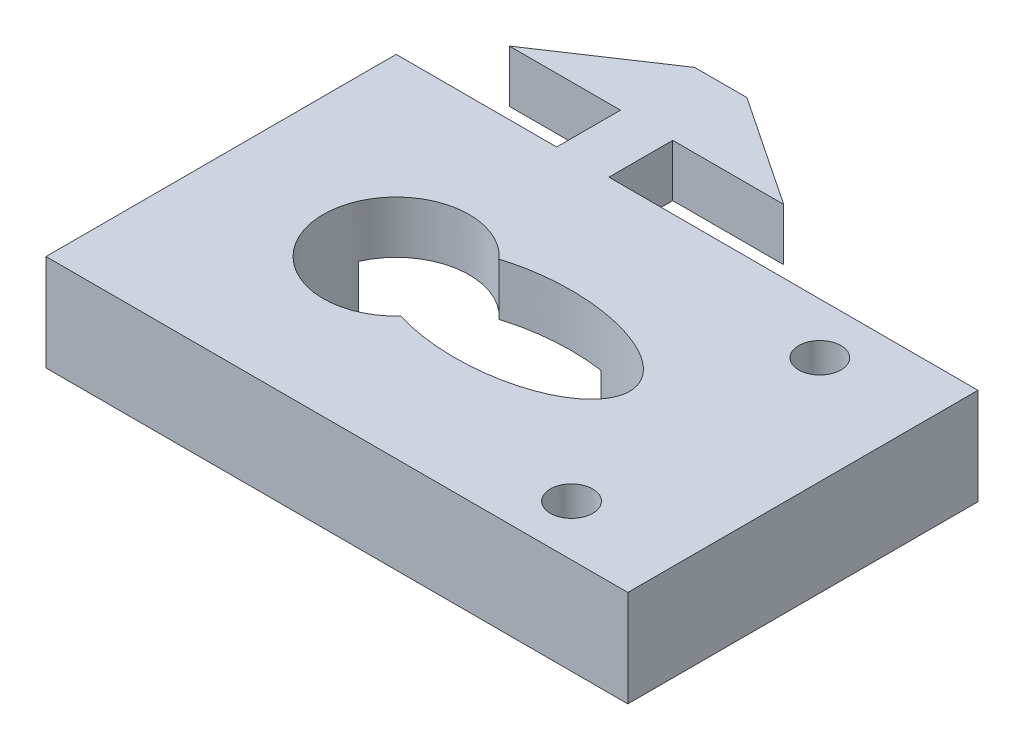
ISO-10303-21;
HEADER;
FILE_DESCRIPTION(('STEP AP214'),'2;1');
FILE_NAME('part.step','',(''),(''),'','','');
FILE_SCHEMA(('AUTOMOTIVE_DESIGN { 1 0 10303 214 1 1 1 1 }'));
ENDSEC;
DATA;
#1=APPLICATION_CONTEXT('core data for automotive mechanical design processes');
#2=APPLICATION_PROTOCOL_DEFINITION('international standard','automotive_design',2000,#1);
#3=PRODUCT_CONTEXT('',#1,'mechanical');
#4=PRODUCT('Part','Part','',(#3));
#5=PRODUCT_RELATED_PRODUCT_CATEGORY('part','',(#4));
#6=PRODUCT_DEFINITION_FORMATION('','',#4);
#7=PRODUCT_DEFINITION_CONTEXT('part definition',#1,'design');
#8=PRODUCT_DEFINITION('design','',#6,#7);
#9=PRODUCT_DEFINITION_SHAPE('','',#8);
#10=(LENGTH_UNIT() NAMED_UNIT(*) SI_UNIT(.MILLI.,.METRE.));
#11=(NAMED_UNIT(*) PLANE_ANGLE_UNIT() SI_UNIT($,.RADIAN.));
#12=(NAMED_UNIT(*) SI_UNIT($,.STERADIAN.) SOLID_ANGLE_UNIT());
#13=UNCERTAINTY_MEASURE_WITH_UNIT(LENGTH_MEASURE(1.E-05),#10,'distance_accuracy_value','');
#14=(GEOMETRIC_REPRESENTATION_CONTEXT(3) GLOBAL_UNCERTAINTY_ASSIGNED_CONTEXT((#13)) GLOBAL_UNIT_ASSIGNED_CONTEXT((#10,
#11,#12)) REPRESENTATION_CONTEXT('',''));
#15=CARTESIAN_POINT('',(0.,0.,0.));
#16=DIRECTION('',(0.,0.,1.));
#17=DIRECTION('',(1.,0.,0.));
#18=AXIS2_PLACEMENT_3D('',#15,#16,#17);
#19=CARTESIAN_POINT('',(0.,3.5814,2.1874988));
#20=DIRECTION('',(0.,0.,1.));
#21=DIRECTION('',(1.,0.,0.));
#22=AXIS2_PLACEMENT_3D('',#19,#20,#21);
#23=PLANE('',#22);
#24=DIRECTION('',(-1.,0.,0.));
#25=VECTOR('',#24,1.);
#26=CARTESIAN_POINT('',(-12.79,-3.035,2.18749880000001));
#27=LINE('',#26,#25);
#28=CARTESIAN_POINT('',(27.088,-3.035,2.18749880000001));
#29=VERTEX_POINT('',#28);
#30=CARTESIAN_POINT('',(9.398,-3.035,2.18749879999999));
#31=VERTEX_POINT('',#30);
#32=EDGE_CURVE('E283',#29,#31,#27,.T.);
#33=ORIENTED_EDGE('',*,*,#32,.T.);
#34=DIRECTION('',(0.,-1.,0.));
#35=VECTOR('',#34,1.);
#36=CARTESIAN_POINT('',(9.398,0.,2.18749879999999));
#37=LINE('',#36,#35);
#38=CARTESIAN_POINT('',(9.398,0.,2.18749879999999));
#39=VERTEX_POINT('',#38);
#40=EDGE_CURVE('E284',#39,#31,#37,.T.);
#41=ORIENTED_EDGE('',*,*,#40,.F.);
#42=DIRECTION('',(1.,0.,0.));
#43=VECTOR('',#42,1.);
#44=CARTESIAN_POINT('',(9.398,0.,2.18749879999999));
#45=LINE('',#44,#43);
#46=CARTESIAN_POINT('',(1.7907,0.,2.1874988));
#47=VERTEX_POINT('',#46);
#48=EDGE_CURVE('E407',#47,#39,#45,.T.);
#49=ORIENTED_EDGE('',*,*,#48,.F.);
#50=DIRECTION('',(0.,-1.,0.));
#51=VECTOR('',#50,1.);
#52=CARTESIAN_POINT('',(1.7907,3.5814,2.1874988));
#53=LINE('',#52,#51);
#54=CARTESIAN_POINT('',(1.7907,3.5814,2.1874988));
#55=VERTEX_POINT('',#54);
#56=EDGE_CURVE('E367',#55,#47,#53,.T.);
#57=ORIENTED_EDGE('',*,*,#56,.F.);
#58=DIRECTION('',(1.,0.,0.));
#59=VECTOR('',#58,1.);
#60=CARTESIAN_POINT('',(0.,3.5814,2.1874988));
#61=LINE('',#60,#59);
#62=CARTESIAN_POINT('',(27.088,3.5814,2.1874988));
#63=VERTEX_POINT('',#62);
#64=EDGE_CURVE('E305',#55,#63,#61,.T.);
#65=ORIENTED_EDGE('',*,*,#64,.T.);
#66=DIRECTION('',(0.,-1.,0.));
#67=VECTOR('',#66,1.);
#68=CARTESIAN_POINT('',(27.088,3.5814,2.1874988));
#69=LINE('',#68,#67);
#70=EDGE_CURVE('E287',#63,#29,#69,.T.);
#71=ORIENTED_EDGE('',*,*,#70,.T.);
#72=EDGE_LOOP('',(#33,#41,#49,#57,#65,#71));
#73=FACE_BOUND('',#72,.T.);
#74=ADVANCED_FACE('F35',(#73),#23,.F.);
#75=CARTESIAN_POINT('',(0.,3.5814,26.1874988));
#76=DIRECTION('',(0.,0.,-1.));
#77=DIRECTION('',(-1.,0.,0.));
#78=AXIS2_PLACEMENT_3D('',#75,#76,#77);
#79=PLANE('',#78);
#80=DIRECTION('',(0.,-1.,0.));
#81=VECTOR('',#80,1.);
#82=CARTESIAN_POINT('',(-12.79,3.5814,26.1874988));
#83=LINE('',#82,#81);
#84=CARTESIAN_POINT('',(-12.79,3.5814,26.1874988));
#85=VERTEX_POINT('',#84);
#86=CARTESIAN_POINT('',(-12.79,-3.035,26.1874988));
#87=VERTEX_POINT('',#86);
#88=EDGE_CURVE('E330',#85,#87,#83,.T.);
#89=ORIENTED_EDGE('',*,*,#88,.T.);
#90=DIRECTION('',(1.,0.,0.));
#91=VECTOR('',#90,1.);
#92=CARTESIAN_POINT('',(-12.79,-3.035,26.1874988));
#93=LINE('',#92,#91);
#94=CARTESIAN_POINT('',(27.088,-3.035,26.1874988));
#95=VERTEX_POINT('',#94);
#96=EDGE_CURVE('E395',#87,#95,#93,.T.);
#97=ORIENTED_EDGE('',*,*,#96,.T.);
#98=DIRECTION('',(0.,-1.,0.));
#99=VECTOR('',#98,1.);
#100=CARTESIAN_POINT('',(27.088,3.5814,26.1874988));
#101=LINE('',#100,#99);
#102=CARTESIAN_POINT('',(27.088,3.5814,26.1874988));
#103=VERTEX_POINT('',#102);
#104=EDGE_CURVE('E371',#103,#95,#101,.T.);
#105=ORIENTED_EDGE('',*,*,#104,.F.);
#106=DIRECTION('',(1.,0.,0.));
#107=VECTOR('',#106,1.);
#108=CARTESIAN_POINT('',(0.,3.5814,26.1874988));
#109=LINE('',#108,#107);
#110=EDGE_CURVE('E299',#85,#103,#109,.T.);
#111=ORIENTED_EDGE('',*,*,#110,.F.);
#112=EDGE_LOOP('',(#89,#97,#105,#111));
#113=FACE_BOUND('',#112,.T.);
#114=ADVANCED_FACE('F37',(#113),#79,.F.);
#115=CARTESIAN_POINT('',(27.088,3.5814,0.));
#116=DIRECTION('',(-1.,0.,0.));
#117=DIRECTION('',(0.,0.,1.));
#118=AXIS2_PLACEMENT_3D('',#115,#116,#117);
#119=PLANE('',#118);
#120=ORIENTED_EDGE('',*,*,#104,.T.);
#121=DIRECTION('',(0.,0.,-1.));
#122=VECTOR('',#121,1.);
#123=CARTESIAN_POINT('',(27.088,-3.035,2.18749880000001));
#124=LINE('',#123,#122);
#125=EDGE_CURVE('E295',#95,#29,#124,.T.);
#126=ORIENTED_EDGE('',*,*,#125,.T.);
#127=ORIENTED_EDGE('',*,*,#70,.F.);
#128=DIRECTION('',(0.,0.,-1.));
#129=VECTOR('',#128,1.);
#130=CARTESIAN_POINT('',(27.088,3.5814,0.));
#131=LINE('',#130,#129);
#132=EDGE_CURVE('E302',#103,#63,#131,.T.);
#133=ORIENTED_EDGE('',*,*,#132,.F.);
#134=EDGE_LOOP('',(#120,#126,#127,#133));
#135=FACE_BOUND('',#134,.T.);
#136=ADVANCED_FACE('F268',(#135),#119,.F.);
#137=CARTESIAN_POINT('',(1.7907,3.5814,0.));
#138=DIRECTION('',(-1.,0.,0.));
#139=DIRECTION('',(0.,0.,1.));
#140=AXIS2_PLACEMENT_3D('',#137,#138,#139);
#141=PLANE('',#140);
#142=DIRECTION('',(0.,0.,-1.));
#143=VECTOR('',#142,1.);
#144=CARTESIAN_POINT('',(1.7907,0.,0.));
#145=LINE('',#144,#143);
#146=CARTESIAN_POINT('',(1.7907,0.,-2.1874988));
#147=VERTEX_POINT('',#146);
#148=EDGE_CURVE('E290',#47,#147,#145,.T.);
#149=ORIENTED_EDGE('',*,*,#148,.T.);
#150=DIRECTION('',(0.,-1.,0.));
#151=VECTOR('',#150,1.);
#152=CARTESIAN_POINT('',(1.7907,3.5814,-2.1874988));
#153=LINE('',#152,#151);
#154=CARTESIAN_POINT('',(1.7907,3.5814,-2.1874988));
#155=VERTEX_POINT('',#154);
#156=EDGE_CURVE('E365',#155,#147,#153,.T.);
#157=ORIENTED_EDGE('',*,*,#156,.F.);
#158=DIRECTION('',(0.,0.,-1.));
#159=VECTOR('',#158,1.);
#160=CARTESIAN_POINT('',(1.7907,3.5814,0.));
#161=LINE('',#160,#159);
#162=EDGE_CURVE('E307',#55,#155,#161,.T.);
#163=ORIENTED_EDGE('',*,*,#162,.F.);
#164=ORIENTED_EDGE('',*,*,#56,.T.);
#165=EDGE_LOOP('',(#149,#157,#163,#164));
#166=FACE_BOUND('',#165,.T.);
#167=ADVANCED_FACE('F265',(#166),#141,.F.);
#168=CARTESIAN_POINT('',(0.,3.5814,-2.1874988));
#169=DIRECTION('',(0.,0.,1.));
#170=DIRECTION('',(1.,0.,0.));
#171=AXIS2_PLACEMENT_3D('',#168,#169,#170);
#172=PLANE('',#171);
#173=DIRECTION('',(-1.,0.,0.));
#174=VECTOR('',#173,1.);
#175=CARTESIAN_POINT('',(0.,0.,-2.1874988));
#176=LINE('',#175,#174);
#177=CARTESIAN_POINT('',(9.398,0.,-2.1874988));
#178=VERTEX_POINT('',#177);
#179=EDGE_CURVE('E293',#178,#147,#176,.T.);
#180=ORIENTED_EDGE('',*,*,#179,.F.);
#181=DIRECTION('',(0.,-1.,0.));
#182=VECTOR('',#181,1.);
#183=CARTESIAN_POINT('',(9.398,3.5814,-2.1874988));
#184=LINE('',#183,#182);
#185=CARTESIAN_POINT('',(9.398,3.5814,-2.1874988));
#186=VERTEX_POINT('',#185);
#187=EDGE_CURVE('E363',#186,#178,#184,.T.);
#188=ORIENTED_EDGE('',*,*,#187,.F.);
#189=DIRECTION('',(-1.,0.,0.));
#190=VECTOR('',#189,1.);
#191=CARTESIAN_POINT('',(0.,3.5814,-2.1874988));
#192=LINE('',#191,#190);
#193=EDGE_CURVE('E309',#186,#155,#192,.T.);
#194=ORIENTED_EDGE('',*,*,#193,.T.);
#195=ORIENTED_EDGE('',*,*,#156,.T.);
#196=EDGE_LOOP('',(#180,#188,#194,#195));
#197=FACE_BOUND('',#196,.T.);
#198=ADVANCED_FACE('F261',(#197),#172,.T.);
#199=CARTESIAN_POINT('',(3.90863686168685,3.5814,-5.85318370037606));
#200=DIRECTION('',(0.55534080959066,0.,-0.831622862362014));
#201=DIRECTION('',(-0.831622862362014,0.,-0.55534080959066));
#202=AXIS2_PLACEMENT_3D('',#199,#200,#201);
#203=PLANE('',#202);
#204=DIRECTION('',(0.831622862362014,0.,0.55534080959066));
#205=VECTOR('',#204,1.);
#206=CARTESIAN_POINT('',(3.90863686168685,0.,-5.85318370037606));
#207=LINE('',#206,#205);
#208=CARTESIAN_POINT('',(1.7907,0.,-7.2674988));
#209=VERTEX_POINT('',#208);
#210=EDGE_CURVE('E334',#209,#178,#207,.T.);
#211=ORIENTED_EDGE('',*,*,#210,.F.);
#212=DIRECTION('',(0.,-1.,0.));
#213=VECTOR('',#212,1.);
#214=CARTESIAN_POINT('',(1.7907,3.5814,-7.2674988));
#215=LINE('',#214,#213);
#216=CARTESIAN_POINT('',(1.7907,3.5814,-7.2674988));
#217=VERTEX_POINT('',#216);
#218=EDGE_CURVE('E361',#217,#209,#215,.T.);
#219=ORIENTED_EDGE('',*,*,#218,.F.);
#220=DIRECTION('',(0.831622862362014,0.,0.55534080959066));
#221=VECTOR('',#220,1.);
#222=CARTESIAN_POINT('',(3.90863686168685,3.5814,-5.85318370037606));
#223=LINE('',#222,#221);
#224=EDGE_CURVE('E312',#217,#186,#223,.T.);
#225=ORIENTED_EDGE('',*,*,#224,.T.);
#226=ORIENTED_EDGE('',*,*,#187,.T.);
#227=EDGE_LOOP('',(#211,#219,#225,#226));
#228=FACE_BOUND('',#227,.T.);
#229=ADVANCED_FACE('F257',(#228),#203,.T.);
#230=CARTESIAN_POINT('',(0.,3.5814,-7.2674988));
#231=DIRECTION('',(0.,0.,-1.));
#232=DIRECTION('',(-1.,0.,0.));
#233=AXIS2_PLACEMENT_3D('',#230,#231,#232);
#234=PLANE('',#233);
#235=DIRECTION('',(1.,0.,0.));
#236=VECTOR('',#235,1.);
#237=CARTESIAN_POINT('',(0.,0.,-7.2674988));
#238=LINE('',#237,#236);
#239=CARTESIAN_POINT('',(-1.7907,0.,-7.2674988));
#240=VERTEX_POINT('',#239);
#241=EDGE_CURVE('E337',#240,#209,#238,.T.);
#242=ORIENTED_EDGE('',*,*,#241,.F.);
#243=DIRECTION('',(0.,-1.,0.));
#244=VECTOR('',#243,1.);
#245=CARTESIAN_POINT('',(-1.7907,3.5814,-7.2674988));
#246=LINE('',#245,#244);
#247=CARTESIAN_POINT('',(-1.7907,3.5814,-7.2674988));
#248=VERTEX_POINT('',#247);
#249=EDGE_CURVE('E359',#248,#240,#246,.T.);
#250=ORIENTED_EDGE('',*,*,#249,.F.);
#251=DIRECTION('',(1.,0.,0.));
#252=VECTOR('',#251,1.);
#253=CARTESIAN_POINT('',(0.,3.5814,-7.2674988));
#254=LINE('',#253,#252);
#255=EDGE_CURVE('E315',#248,#217,#254,.T.);
#256=ORIENTED_EDGE('',*,*,#255,.T.);
#257=ORIENTED_EDGE('',*,*,#218,.T.);
#258=EDGE_LOOP('',(#242,#250,#256,#257));
#259=FACE_BOUND('',#258,.T.);
#260=ADVANCED_FACE('F253',(#259),#234,.T.);
#261=CARTESIAN_POINT('',(-3.90863686168685,3.5814,-5.85318370037606));
#262=DIRECTION('',(-0.55534080959066,0.,-0.831622862362014));
#263=DIRECTION('',(-0.831622862362014,0.,0.55534080959066));
#264=AXIS2_PLACEMENT_3D('',#261,#262,#263);
#265=PLANE('',#264);
#266=DIRECTION('',(0.831622862362014,0.,-0.55534080959066));
#267=VECTOR('',#266,1.);
#268=CARTESIAN_POINT('',(-3.90863686168685,0.,-5.85318370037606));
#269=LINE('',#268,#267);
#270=CARTESIAN_POINT('',(-9.398,0.,-2.1874988));
#271=VERTEX_POINT('',#270);
#272=EDGE_CURVE('E340',#271,#240,#269,.T.);
#273=ORIENTED_EDGE('',*,*,#272,.F.);
#274=DIRECTION('',(0.,-1.,0.));
#275=VECTOR('',#274,1.);
#276=CARTESIAN_POINT('',(-9.398,3.5814,-2.1874988));
#277=LINE('',#276,#275);
#278=CARTESIAN_POINT('',(-9.398,3.5814,-2.1874988));
#279=VERTEX_POINT('',#278);
#280=EDGE_CURVE('E357',#279,#271,#277,.T.);
#281=ORIENTED_EDGE('',*,*,#280,.F.);
#282=DIRECTION('',(0.831622862362014,0.,-0.55534080959066));
#283=VECTOR('',#282,1.);
#284=CARTESIAN_POINT('',(-3.90863686168685,3.5814,-5.85318370037606));
#285=LINE('',#284,#283);
#286=EDGE_CURVE('E318',#279,#248,#285,.T.);
#287=ORIENTED_EDGE('',*,*,#286,.T.);
#288=ORIENTED_EDGE('',*,*,#249,.T.);
#289=EDGE_LOOP('',(#273,#281,#287,#288));
#290=FACE_BOUND('',#289,.T.);
#291=ADVANCED_FACE('F249',(#290),#265,.T.);
#292=CARTESIAN_POINT('',(0.,3.5814,-2.1874988));
#293=DIRECTION('',(0.,0.,1.));
#294=DIRECTION('',(1.,0.,0.));
#295=AXIS2_PLACEMENT_3D('',#292,#293,#294);
#296=PLANE('',#295);
#297=DIRECTION('',(-1.,0.,0.));
#298=VECTOR('',#297,1.);
#299=CARTESIAN_POINT('',(0.,0.,-2.1874988));
#300=LINE('',#299,#298);
#301=CARTESIAN_POINT('',(-1.7907,0.,-2.1874988));
#302=VERTEX_POINT('',#301);
#303=EDGE_CURVE('E343',#302,#271,#300,.T.);
#304=ORIENTED_EDGE('',*,*,#303,.F.);
#305=DIRECTION('',(0.,-1.,0.));
#306=VECTOR('',#305,1.);
#307=CARTESIAN_POINT('',(-1.7907,3.5814,-2.1874988));
#308=LINE('',#307,#306);
#309=CARTESIAN_POINT('',(-1.7907,3.5814,-2.1874988));
#310=VERTEX_POINT('',#309);
#311=EDGE_CURVE('E355',#310,#302,#308,.T.);
#312=ORIENTED_EDGE('',*,*,#311,.F.);
#313=DIRECTION('',(-1.,0.,0.));
#314=VECTOR('',#313,1.);
#315=CARTESIAN_POINT('',(0.,3.5814,-2.1874988));
#316=LINE('',#315,#314);
#317=EDGE_CURVE('E321',#310,#279,#316,.T.);
#318=ORIENTED_EDGE('',*,*,#317,.T.);
#319=ORIENTED_EDGE('',*,*,#280,.T.);
#320=EDGE_LOOP('',(#304,#312,#318,#319));
#321=FACE_BOUND('',#320,.T.);
#322=ADVANCED_FACE('F245',(#321),#296,.T.);
#323=CARTESIAN_POINT('',(-1.7907,3.5814,0.));
#324=DIRECTION('',(-1.,0.,0.));
#325=DIRECTION('',(0.,0.,1.));
#326=AXIS2_PLACEMENT_3D('',#323,#324,#325);
#327=PLANE('',#326);
#328=DIRECTION('',(0.,0.,-1.));
#329=VECTOR('',#328,1.);
#330=CARTESIAN_POINT('',(-1.7907,0.,0.));
#331=LINE('',#330,#329);
#332=CARTESIAN_POINT('',(-1.7907,0.,2.1874988));
#333=VERTEX_POINT('',#332);
#334=EDGE_CURVE('E303',#333,#302,#331,.T.);
#335=ORIENTED_EDGE('',*,*,#334,.F.);
#336=DIRECTION('',(0.,-1.,0.));
#337=VECTOR('',#336,1.);
#338=CARTESIAN_POINT('',(-1.7907,3.5814,2.1874988));
#339=LINE('',#338,#337);
#340=CARTESIAN_POINT('',(-1.7907,3.5814,2.1874988));
#341=VERTEX_POINT('',#340);
#342=EDGE_CURVE('E352',#341,#333,#339,.T.);
#343=ORIENTED_EDGE('',*,*,#342,.F.);
#344=DIRECTION('',(0.,0.,-1.));
#345=VECTOR('',#344,1.);
#346=CARTESIAN_POINT('',(-1.7907,3.5814,0.));
#347=LINE('',#346,#345);
#348=EDGE_CURVE('E324',#341,#310,#347,.T.);
#349=ORIENTED_EDGE('',*,*,#348,.T.);
#350=ORIENTED_EDGE('',*,*,#311,.T.);
#351=EDGE_LOOP('',(#335,#343,#349,#350));
#352=FACE_BOUND('',#351,.T.);
#353=ADVANCED_FACE('F241',(#352),#327,.T.);
#354=ORIENTED_EDGE('',*,*,#342,.T.);
#355=CARTESIAN_POINT('',(-9.398,0.,2.1874988));
#356=VERTEX_POINT('',#355);
#357=EDGE_CURVE('E175',#356,#333,#45,.T.);
#358=ORIENTED_EDGE('',*,*,#357,.F.);
#359=DIRECTION('',(0.,1.,0.));
#360=VECTOR('',#359,1.);
#361=CARTESIAN_POINT('',(-9.398,0.,2.1874988));
#362=LINE('',#361,#360);
#363=CARTESIAN_POINT('',(-9.39799999999999,-3.035,2.1874988));
#364=VERTEX_POINT('',#363);
#365=EDGE_CURVE('E406',#364,#356,#362,.T.);
#366=ORIENTED_EDGE('',*,*,#365,.F.);
#367=CARTESIAN_POINT('',(-12.79,-3.035,2.18749880000001));
#368=VERTEX_POINT('',#367);
#369=EDGE_CURVE('E188',#364,#368,#27,.T.);
#370=ORIENTED_EDGE('',*,*,#369,.T.);
#371=DIRECTION('',(0.,-1.,0.));
#372=VECTOR('',#371,1.);
#373=CARTESIAN_POINT('',(-12.79,3.5814,2.18749880000001));
#374=LINE('',#373,#372);
#375=CARTESIAN_POINT('',(-12.79,3.5814,2.18749880000001));
#376=VERTEX_POINT('',#375);
#377=EDGE_CURVE('E349',#376,#368,#374,.T.);
#378=ORIENTED_EDGE('',*,*,#377,.F.);
#379=DIRECTION('',(-1.,0.,0.));
#380=VECTOR('',#379,1.);
#381=CARTESIAN_POINT('',(0.,3.5814,2.1874988));
#382=LINE('',#381,#380);
#383=EDGE_CURVE('E327',#341,#376,#382,.T.);
#384=ORIENTED_EDGE('',*,*,#383,.F.);
#385=EDGE_LOOP('',(#354,#358,#366,#370,#378,#384));
#386=FACE_BOUND('',#385,.T.);
#387=ADVANCED_FACE('F237',(#386),#23,.F.);
#388=CARTESIAN_POINT('',(-12.79,3.5814,0.));
#389=DIRECTION('',(1.,0.,0.));
#390=DIRECTION('',(0.,0.,-1.));
#391=AXIS2_PLACEMENT_3D('',#388,#389,#390);
#392=PLANE('',#391);
#393=ORIENTED_EDGE('',*,*,#377,.T.);
#394=DIRECTION('',(0.,0.,1.));
#395=VECTOR('',#394,1.);
#396=CARTESIAN_POINT('',(-12.79,-3.035,2.18749880000001));
#397=LINE('',#396,#395);
#398=EDGE_CURVE('E393',#368,#87,#397,.T.);
#399=ORIENTED_EDGE('',*,*,#398,.T.);
#400=ORIENTED_EDGE('',*,*,#88,.F.);
#401=DIRECTION('',(0.,0.,1.));
#402=VECTOR('',#401,1.);
#403=CARTESIAN_POINT('',(-12.79,3.5814,0.));
#404=LINE('',#403,#402);
#405=EDGE_CURVE('E329',#376,#85,#404,.T.);
#406=ORIENTED_EDGE('',*,*,#405,.F.);
#407=EDGE_LOOP('',(#393,#399,#400,#406));
#408=FACE_BOUND('',#407,.T.);
#409=ADVANCED_FACE('F230',(#408),#392,.F.);
#410=CARTESIAN_POINT('',(0.,3.5814,0.));
#411=DIRECTION('',(0.,1.,0.));
#412=DIRECTION('',(0.,0.,1.));
#413=AXIS2_PLACEMENT_3D('',#410,#411,#412);
#414=PLANE('',#413);
#415=CARTESIAN_POINT('',(7.21000000000003,3.5814,14.1874988));
#416=DIRECTION('',(0.,1.,0.));
#417=DIRECTION('',(-1.,0.,0.));
#418=AXIS2_PLACEMENT_3D('',#415,#416,#417);
#419=ELLIPSE('',#418,8.00000000000003,4.00000000000001);
#420=CARTESIAN_POINT('',(2.9029280094463,3.5814,17.5582973281009));
#421=VERTEX_POINT('',#420);
#422=CARTESIAN_POINT('',(2.9029280094463,3.5814,10.8167002718991));
#423=VERTEX_POINT('',#422);
#424=EDGE_CURVE('E375',#421,#423,#419,.T.);
#425=ORIENTED_EDGE('',*,*,#424,.F.);
#426=CARTESIAN_POINT('',(-0.789999999999997,3.5814,14.1874988));
#427=DIRECTION('',(0.,1.,0.));
#428=DIRECTION('',(0.,0.,1.));
#429=AXIS2_PLACEMENT_3D('',#426,#427,#428);
#430=CIRCLE('',#429,5.);
#431=EDGE_CURVE('E390',#423,#421,#430,.T.);
#432=ORIENTED_EDGE('',*,*,#431,.F.);
#433=EDGE_LOOP('',(#425,#432));
#434=FACE_BOUND('',#433,.T.);
#435=CARTESIAN_POINT('',(19.738,3.5814,22.6964988));
#436=DIRECTION('',(0.,1.,0.));
#437=DIRECTION('',(0.,0.,1.));
#438=AXIS2_PLACEMENT_3D('',#435,#436,#437);
#439=CIRCLE('',#438,1.45);
#440=CARTESIAN_POINT('',(19.738,3.5814,24.1464988));
#441=VERTEX_POINT('',#440);
#442=EDGE_CURVE('E387',#441,#441,#439,.T.);
#443=ORIENTED_EDGE('',*,*,#442,.F.);
#444=EDGE_LOOP('',(#443));
#445=FACE_BOUND('',#444,.T.);
#446=CARTESIAN_POINT('',(19.738,3.5814,5.6784988));
#447=DIRECTION('',(0.,1.,0.));
#448=DIRECTION('',(0.,0.,1.));
#449=AXIS2_PLACEMENT_3D('',#446,#447,#448);
#450=CIRCLE('',#449,1.45);
#451=CARTESIAN_POINT('',(19.738,3.5814,7.1284988));
#452=VERTEX_POINT('',#451);
#453=EDGE_CURVE('E379',#452,#452,#450,.T.);
#454=ORIENTED_EDGE('',*,*,#453,.F.);
#455=EDGE_LOOP('',(#454));
#456=FACE_BOUND('',#455,.T.);
#457=ORIENTED_EDGE('',*,*,#110,.T.);
#458=ORIENTED_EDGE('',*,*,#132,.T.);
#459=ORIENTED_EDGE('',*,*,#64,.F.);
#460=ORIENTED_EDGE('',*,*,#162,.T.);
#461=ORIENTED_EDGE('',*,*,#193,.F.);
#462=ORIENTED_EDGE('',*,*,#224,.F.);
#463=ORIENTED_EDGE('',*,*,#255,.F.);
#464=ORIENTED_EDGE('',*,*,#286,.F.);
#465=ORIENTED_EDGE('',*,*,#317,.F.);
#466=ORIENTED_EDGE('',*,*,#348,.F.);
#467=ORIENTED_EDGE('',*,*,#383,.T.);
#468=ORIENTED_EDGE('',*,*,#405,.T.);
#469=EDGE_LOOP('',(#457,#458,#459,#460,#461,#462,#463,#464,#465,#466,#467,#468));
#470=FACE_BOUND('',#469,.T.);
#471=ADVANCED_FACE('F227',(#434,#445,#456,#470),#414,.T.);
#472=CARTESIAN_POINT('',(0.,0.,0.));
#473=DIRECTION('',(0.,1.,0.));
#474=DIRECTION('',(0.,0.,1.));
#475=AXIS2_PLACEMENT_3D('',#472,#473,#474);
#476=PLANE('',#475);
#477=ORIENTED_EDGE('',*,*,#148,.F.);
#478=ORIENTED_EDGE('',*,*,#48,.T.);
#479=DIRECTION('',(0.,0.,-1.));
#480=VECTOR('',#479,1.);
#481=CARTESIAN_POINT('',(9.39800000000001,0.,12.1874988));
#482=LINE('',#481,#480);
#483=CARTESIAN_POINT('',(9.39800000000001,0.,10.3400107883228));
#484=VERTEX_POINT('',#483);
#485=EDGE_CURVE('E191',#484,#39,#482,.T.);
#486=ORIENTED_EDGE('',*,*,#485,.F.);
#487=CARTESIAN_POINT('',(7.21000000000003,0.,14.1874988));
#488=DIRECTION('',(0.,1.,0.));
#489=DIRECTION('',(-1.,0.,0.));
#490=AXIS2_PLACEMENT_3D('',#487,#488,#489);
#491=ELLIPSE('',#490,8.00000000000003,4.00000000000001);
#492=CARTESIAN_POINT('',(2.9029280094463,0.,10.8167002718991));
#493=VERTEX_POINT('',#492);
#494=EDGE_CURVE('E197',#493,#484,#491,.F.);
#495=ORIENTED_EDGE('',*,*,#494,.F.);
#496=CARTESIAN_POINT('',(-0.789999999999997,0.,14.1874988));
#497=DIRECTION('',(0.,1.,0.));
#498=DIRECTION('',(0.,0.,1.));
#499=AXIS2_PLACEMENT_3D('',#496,#497,#498);
#500=CIRCLE('',#499,5.);
#501=CARTESIAN_POINT('',(-5.37257569495584,0.,12.1874988));
#502=VERTEX_POINT('',#501);
#503=EDGE_CURVE('E43',#502,#493,#500,.F.);
#504=ORIENTED_EDGE('',*,*,#503,.F.);
#505=DIRECTION('',(1.,0.,0.));
#506=VECTOR('',#505,1.);
#507=CARTESIAN_POINT('',(9.39800000000001,0.,12.1874988));
#508=LINE('',#507,#506);
#509=CARTESIAN_POINT('',(-9.39799999999999,0.,12.1874988));
#510=VERTEX_POINT('',#509);
#511=EDGE_CURVE('E50',#510,#502,#508,.T.);
#512=ORIENTED_EDGE('',*,*,#511,.F.);
#513=DIRECTION('',(0.,0.,-1.));
#514=VECTOR('',#513,1.);
#515=CARTESIAN_POINT('',(-9.39799999999999,0.,12.1874988));
#516=LINE('',#515,#514);
#517=EDGE_CURVE('E182',#510,#356,#516,.T.);
#518=ORIENTED_EDGE('',*,*,#517,.T.);
#519=ORIENTED_EDGE('',*,*,#357,.T.);
#520=ORIENTED_EDGE('',*,*,#334,.T.);
#521=ORIENTED_EDGE('',*,*,#303,.T.);
#522=ORIENTED_EDGE('',*,*,#272,.T.);
#523=ORIENTED_EDGE('',*,*,#241,.T.);
#524=ORIENTED_EDGE('',*,*,#210,.T.);
#525=ORIENTED_EDGE('',*,*,#179,.T.);
#526=EDGE_LOOP('',(#477,#478,#486,#495,#504,#512,#518,#519,#520,#521,#522,#523,#524,#525));
#527=FACE_BOUND('',#526,.T.);
#528=ADVANCED_FACE('F225',(#527),#476,.F.);
#529=CARTESIAN_POINT('',(0.,-3.035,0.));
#530=DIRECTION('',(0.,1.,0.));
#531=DIRECTION('',(0.,0.,1.));
#532=AXIS2_PLACEMENT_3D('',#529,#530,#531);
#533=PLANE('',#532);
#534=CARTESIAN_POINT('',(19.738,-3.035,22.6964988));
#535=DIRECTION('',(0.,1.,0.));
#536=DIRECTION('',(0.,0.,1.));
#537=AXIS2_PLACEMENT_3D('',#534,#535,#536);
#538=CIRCLE('',#537,1.45);
#539=CARTESIAN_POINT('',(19.738,-3.035,24.1464988));
#540=VERTEX_POINT('',#539);
#541=EDGE_CURVE('E205',#540,#540,#538,.T.);
#542=ORIENTED_EDGE('',*,*,#541,.T.);
#543=EDGE_LOOP('',(#542));
#544=FACE_BOUND('',#543,.T.);
#545=CARTESIAN_POINT('',(19.738,-3.035,5.6784988));
#546=DIRECTION('',(0.,1.,0.));
#547=DIRECTION('',(0.,0.,1.));
#548=AXIS2_PLACEMENT_3D('',#545,#546,#547);
#549=CIRCLE('',#548,1.45);
#550=CARTESIAN_POINT('',(19.738,-3.035,7.1284988));
#551=VERTEX_POINT('',#550);
#552=EDGE_CURVE('E200',#551,#551,#549,.T.);
#553=ORIENTED_EDGE('',*,*,#552,.T.);
#554=EDGE_LOOP('',(#553));
#555=FACE_BOUND('',#554,.T.);
#556=CARTESIAN_POINT('',(7.21000000000003,-3.035,14.1874988));
#557=DIRECTION('',(0.,1.,0.));
#558=DIRECTION('',(-1.,0.,0.));
#559=AXIS2_PLACEMENT_3D('',#556,#557,#558);
#560=ELLIPSE('',#559,8.00000000000003,4.00000000000001);
#561=CARTESIAN_POINT('',(2.9029280094463,-3.035,17.5582973281009));
#562=VERTEX_POINT('',#561);
#563=CARTESIAN_POINT('',(9.39800000000001,-3.035,10.3400107883228));
#564=VERTEX_POINT('',#563);
#565=EDGE_CURVE('E201',#562,#564,#560,.T.);
#566=ORIENTED_EDGE('',*,*,#565,.T.);
#567=DIRECTION('',(0.,0.,-1.));
#568=VECTOR('',#567,1.);
#569=CARTESIAN_POINT('',(9.39800000000001,-3.035,12.1874988));
#570=LINE('',#569,#568);
#571=EDGE_CURVE('E189',#564,#31,#570,.T.);
#572=ORIENTED_EDGE('',*,*,#571,.T.);
#573=ORIENTED_EDGE('',*,*,#32,.F.);
#574=ORIENTED_EDGE('',*,*,#125,.F.);
#575=ORIENTED_EDGE('',*,*,#96,.F.);
#576=ORIENTED_EDGE('',*,*,#398,.F.);
#577=ORIENTED_EDGE('',*,*,#369,.F.);
#578=DIRECTION('',(0.,0.,-1.));
#579=VECTOR('',#578,1.);
#580=CARTESIAN_POINT('',(-9.39799999999999,-3.035,12.1874988));
#581=LINE('',#580,#579);
#582=CARTESIAN_POINT('',(-9.39799999999999,-3.035,12.1874988));
#583=VERTEX_POINT('',#582);
#584=EDGE_CURVE('E180',#583,#364,#581,.T.);
#585=ORIENTED_EDGE('',*,*,#584,.F.);
#586=DIRECTION('',(-1.,0.,0.));
#587=VECTOR('',#586,1.);
#588=CARTESIAN_POINT('',(9.39800000000001,-3.035,12.1874988));
#589=LINE('',#588,#587);
#590=CARTESIAN_POINT('',(-5.37257569495584,-3.035,12.1874988));
#591=VERTEX_POINT('',#590);
#592=EDGE_CURVE('E166',#591,#583,#589,.T.);
#593=ORIENTED_EDGE('',*,*,#592,.F.);
#594=CARTESIAN_POINT('',(-0.789999999999997,-3.035,14.1874988));
#595=DIRECTION('',(0.,1.,0.));
#596=DIRECTION('',(0.,0.,1.));
#597=AXIS2_PLACEMENT_3D('',#594,#595,#596);
#598=CIRCLE('',#597,5.);
#599=EDGE_CURVE('E204',#591,#562,#598,.T.);
#600=ORIENTED_EDGE('',*,*,#599,.T.);
#601=EDGE_LOOP('',(#566,#572,#573,#574,#575,#576,#577,#585,#593,#600));
#602=FACE_BOUND('',#601,.T.);
#603=ADVANCED_FACE('F186',(#544,#555,#602),#533,.F.);
#604=CARTESIAN_POINT('',(19.738,-3.035,5.6784988));
#605=DIRECTION('',(0.,1.,0.));
#606=DIRECTION('',(0.,0.,1.));
#607=AXIS2_PLACEMENT_3D('',#604,#605,#606);
#608=CYLINDRICAL_SURFACE('',#607,1.45);
#609=ORIENTED_EDGE('',*,*,#453,.T.);
#610=EDGE_LOOP('',(#609));
#611=FACE_BOUND('',#610,.T.);
#612=ORIENTED_EDGE('',*,*,#552,.F.);
#613=EDGE_LOOP('',(#612));
#614=FACE_BOUND('',#613,.T.);
#615=ADVANCED_FACE('F218',(#611,#614),#608,.F.);
#616=CARTESIAN_POINT('',(19.738,-3.035,22.6964988));
#617=DIRECTION('',(0.,1.,0.));
#618=DIRECTION('',(0.,0.,1.));
#619=AXIS2_PLACEMENT_3D('',#616,#617,#618);
#620=CYLINDRICAL_SURFACE('',#619,1.45);
#621=ORIENTED_EDGE('',*,*,#442,.T.);
#622=EDGE_LOOP('',(#621));
#623=FACE_BOUND('',#622,.T.);
#624=ORIENTED_EDGE('',*,*,#541,.F.);
#625=EDGE_LOOP('',(#624));
#626=FACE_BOUND('',#625,.T.);
#627=ADVANCED_FACE('F213',(#623,#626),#620,.F.);
#628=DIRECTION('',(0.,1.,0.));
#629=VECTOR('',#628,1.);
#630=SURFACE_OF_LINEAR_EXTRUSION('',#560,#629);
#631=ORIENTED_EDGE('',*,*,#494,.T.);
#632=DIRECTION('',(0.,1.,0.));
#633=VECTOR('',#632,1.);
#634=CARTESIAN_POINT('',(9.39800000000001,-3.035,10.3400107883228));
#635=LINE('',#634,#633);
#636=EDGE_CURVE('E11',#484,#564,#635,.F.);
#637=ORIENTED_EDGE('',*,*,#636,.T.);
#638=ORIENTED_EDGE('',*,*,#565,.F.);
#639=DIRECTION('',(0.,1.,0.));
#640=VECTOR('',#639,1.);
#641=CARTESIAN_POINT('',(2.9029280094463,-3.035,17.5582973281009));
#642=LINE('',#641,#640);
#643=EDGE_CURVE('E377',#562,#421,#642,.T.);
#644=ORIENTED_EDGE('',*,*,#643,.T.);
#645=ORIENTED_EDGE('',*,*,#424,.T.);
#646=DIRECTION('',(0.,1.,0.));
#647=VECTOR('',#646,1.);
#648=CARTESIAN_POINT('',(2.9029280094463,-3.035,10.8167002718991));
#649=LINE('',#648,#647);
#650=EDGE_CURVE('E58',#493,#423,#649,.T.);
#651=ORIENTED_EDGE('',*,*,#650,.F.);
#652=EDGE_LOOP('',(#631,#637,#638,#644,#645,#651));
#653=FACE_BOUND('',#652,.T.);
#654=ADVANCED_FACE('F208',(#653),#630,.F.);
#655=CARTESIAN_POINT('',(-0.789999999999997,-3.035,14.1874988));
#656=DIRECTION('',(0.,1.,0.));
#657=DIRECTION('',(0.,0.,1.));
#658=AXIS2_PLACEMENT_3D('',#655,#656,#657);
#659=CYLINDRICAL_SURFACE('',#658,5.);
#660=DIRECTION('',(0.,1.,0.));
#661=VECTOR('',#660,1.);
#662=CARTESIAN_POINT('',(-5.37257569495584,-3.035,12.1874988));
#663=LINE('',#662,#661);
#664=EDGE_CURVE('E171',#502,#591,#663,.F.);
#665=ORIENTED_EDGE('',*,*,#664,.F.);
#666=ORIENTED_EDGE('',*,*,#503,.T.);
#667=ORIENTED_EDGE('',*,*,#650,.T.);
#668=ORIENTED_EDGE('',*,*,#431,.T.);
#669=ORIENTED_EDGE('',*,*,#643,.F.);
#670=ORIENTED_EDGE('',*,*,#599,.F.);
#671=EDGE_LOOP('',(#665,#666,#667,#668,#669,#670));
#672=FACE_BOUND('',#671,.T.);
#673=ADVANCED_FACE('F212',(#672),#659,.F.);
#674=CARTESIAN_POINT('',(9.39800000000001,0.,12.1874988));
#675=DIRECTION('',(1.,0.,0.));
#676=DIRECTION('',(0.,0.,-1.));
#677=AXIS2_PLACEMENT_3D('',#674,#675,#676);
#678=PLANE('',#677);
#679=ORIENTED_EDGE('',*,*,#485,.T.);
#680=ORIENTED_EDGE('',*,*,#40,.T.);
#681=ORIENTED_EDGE('',*,*,#571,.F.);
#682=ORIENTED_EDGE('',*,*,#636,.F.);
#683=EDGE_LOOP('',(#679,#680,#681,#682));
#684=FACE_BOUND('',#683,.T.);
#685=ADVANCED_FACE('F415',(#684),#678,.F.);
#686=CARTESIAN_POINT('',(0.,0.,12.1874988));
#687=DIRECTION('',(0.,0.,-1.));
#688=DIRECTION('',(-1.,0.,0.));
#689=AXIS2_PLACEMENT_3D('',#686,#687,#688);
#690=PLANE('',#689);
#691=ORIENTED_EDGE('',*,*,#664,.T.);
#692=ORIENTED_EDGE('',*,*,#592,.T.);
#693=DIRECTION('',(0.,1.,0.));
#694=VECTOR('',#693,1.);
#695=CARTESIAN_POINT('',(-9.39799999999999,0.,12.1874988));
#696=LINE('',#695,#694);
#697=EDGE_CURVE('E169',#583,#510,#696,.T.);
#698=ORIENTED_EDGE('',*,*,#697,.T.);
#699=ORIENTED_EDGE('',*,*,#511,.T.);
#700=EDGE_LOOP('',(#691,#692,#698,#699));
#701=FACE_BOUND('',#700,.T.);
#702=ADVANCED_FACE('F168',(#701),#690,.T.);
#703=CARTESIAN_POINT('',(-9.39799999999999,0.,12.1874988));
#704=DIRECTION('',(-1.,0.,0.));
#705=DIRECTION('',(0.,0.,1.));
#706=AXIS2_PLACEMENT_3D('',#703,#704,#705);
#707=PLANE('',#706);
#708=ORIENTED_EDGE('',*,*,#365,.T.);
#709=ORIENTED_EDGE('',*,*,#517,.F.);
#710=ORIENTED_EDGE('',*,*,#697,.F.);
#711=ORIENTED_EDGE('',*,*,#584,.T.);
#712=EDGE_LOOP('',(#708,#709,#710,#711));
#713=FACE_BOUND('',#712,.T.);
#714=ADVANCED_FACE('F179',(#713),#707,.F.);
#715=CLOSED_SHELL('',(#74,#114,#136,#167,#198,#229,#260,#291,#322,#353,#387,#409,#471,#528,#603,
#615,#627,#654,#673,#685,#702,#714));
#716=MANIFOLD_SOLID_BREP('B2',#715);
#717=ADVANCED_BREP_SHAPE_REPRESENTATION('',(#18,#716),#14);
#718=SHAPE_DEFINITION_REPRESENTATION(#9,#717);
ENDSEC;
END-ISO-10303-21;
